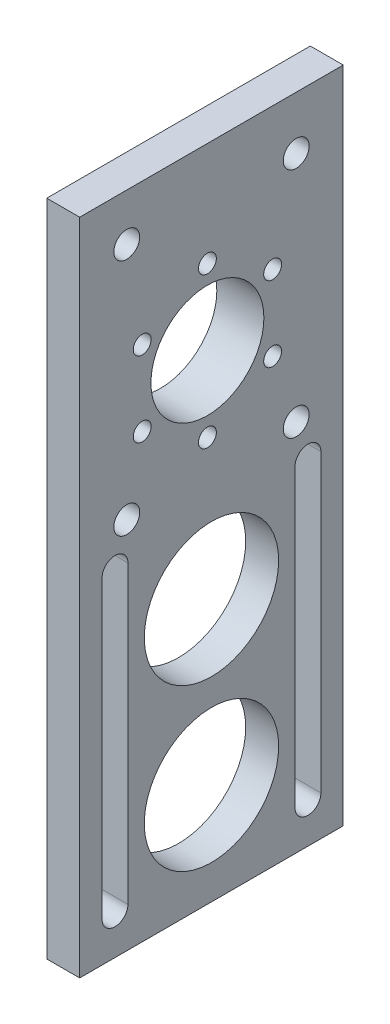
ISO-10303-21;
HEADER;
FILE_DESCRIPTION(('STEP AP214'),'2;1');
FILE_NAME('part.step','',(''),(''),'','','');
FILE_SCHEMA(('AUTOMOTIVE_DESIGN { 1 0 10303 214 1 1 1 1 }'));
ENDSEC;
DATA;
#1=APPLICATION_CONTEXT('core data for automotive mechanical design processes');
#2=APPLICATION_PROTOCOL_DEFINITION('international standard','automotive_design',2000,#1);
#3=PRODUCT_CONTEXT('',#1,'mechanical');
#4=PRODUCT('Part','Part','',(#3));
#5=PRODUCT_RELATED_PRODUCT_CATEGORY('part','',(#4));
#6=PRODUCT_DEFINITION_FORMATION('','',#4);
#7=PRODUCT_DEFINITION_CONTEXT('part definition',#1,'design');
#8=PRODUCT_DEFINITION('design','',#6,#7);
#9=PRODUCT_DEFINITION_SHAPE('','',#8);
#10=(LENGTH_UNIT() NAMED_UNIT(*) SI_UNIT(.MILLI.,.METRE.));
#11=(NAMED_UNIT(*) PLANE_ANGLE_UNIT() SI_UNIT($,.RADIAN.));
#12=(NAMED_UNIT(*) SI_UNIT($,.STERADIAN.) SOLID_ANGLE_UNIT());
#13=UNCERTAINTY_MEASURE_WITH_UNIT(LENGTH_MEASURE(1.E-05),#10,'distance_accuracy_value','');
#14=(GEOMETRIC_REPRESENTATION_CONTEXT(3) GLOBAL_UNCERTAINTY_ASSIGNED_CONTEXT((#13)) GLOBAL_UNIT_ASSIGNED_CONTEXT((#10,
#11,#12)) REPRESENTATION_CONTEXT('',''));
#15=CARTESIAN_POINT('',(0.,0.,0.));
#16=DIRECTION('',(0.,0.,1.));
#17=DIRECTION('',(1.,0.,0.));
#18=AXIS2_PLACEMENT_3D('',#15,#16,#17);
#19=CARTESIAN_POINT('',(7.,0.,0.));
#20=DIRECTION('',(0.,0.,-1.));
#21=DIRECTION('',(-1.,0.,0.));
#22=AXIS2_PLACEMENT_3D('',#19,#20,#21);
#23=PLANE('',#22);
#24=DIRECTION('',(0.,-1.,0.));
#25=VECTOR('',#24,1.);
#26=CARTESIAN_POINT('',(0.,0.,0.));
#27=LINE('',#26,#25);
#28=CARTESIAN_POINT('',(0.,140.,0.));
#29=VERTEX_POINT('',#28);
#30=CARTESIAN_POINT('',(0.,0.,0.));
#31=VERTEX_POINT('',#30);
#32=EDGE_CURVE('E277',#29,#31,#27,.T.);
#33=ORIENTED_EDGE('',*,*,#32,.T.);
#34=DIRECTION('',(-1.,0.,0.));
#35=VECTOR('',#34,1.);
#36=CARTESIAN_POINT('',(7.,0.,0.));
#37=LINE('',#36,#35);
#38=CARTESIAN_POINT('',(7.,0.,0.));
#39=VERTEX_POINT('',#38);
#40=EDGE_CURVE('E11',#39,#31,#37,.T.);
#41=ORIENTED_EDGE('',*,*,#40,.F.);
#42=DIRECTION('',(0.,-1.,0.));
#43=VECTOR('',#42,1.);
#44=CARTESIAN_POINT('',(7.,0.,0.));
#45=LINE('',#44,#43);
#46=CARTESIAN_POINT('',(7.,140.,0.));
#47=VERTEX_POINT('',#46);
#48=EDGE_CURVE('E309',#47,#39,#45,.T.);
#49=ORIENTED_EDGE('',*,*,#48,.F.);
#50=DIRECTION('',(-1.,0.,0.));
#51=VECTOR('',#50,1.);
#52=CARTESIAN_POINT('',(7.,140.,0.));
#53=LINE('',#52,#51);
#54=EDGE_CURVE('E318',#47,#29,#53,.T.);
#55=ORIENTED_EDGE('',*,*,#54,.T.);
#56=EDGE_LOOP('',(#33,#41,#49,#55));
#57=FACE_BOUND('',#56,.T.);
#58=ADVANCED_FACE('F39',(#57),#23,.F.);
#59=CARTESIAN_POINT('',(7.,0.,0.));
#60=DIRECTION('',(0.,1.,0.));
#61=DIRECTION('',(0.,0.,1.));
#62=AXIS2_PLACEMENT_3D('',#59,#60,#61);
#63=PLANE('',#62);
#64=DIRECTION('',(0.,0.,-1.));
#65=VECTOR('',#64,1.);
#66=CARTESIAN_POINT('',(0.,0.,0.));
#67=LINE('',#66,#65);
#68=CARTESIAN_POINT('',(0.,0.,-56.));
#69=VERTEX_POINT('',#68);
#70=EDGE_CURVE('E325',#31,#69,#67,.T.);
#71=ORIENTED_EDGE('',*,*,#70,.T.);
#72=DIRECTION('',(-1.,0.,0.));
#73=VECTOR('',#72,1.);
#74=CARTESIAN_POINT('',(7.,0.,-56.));
#75=LINE('',#74,#73);
#76=CARTESIAN_POINT('',(7.,0.,-56.));
#77=VERTEX_POINT('',#76);
#78=EDGE_CURVE('E46',#77,#69,#75,.T.);
#79=ORIENTED_EDGE('',*,*,#78,.F.);
#80=DIRECTION('',(0.,0.,-1.));
#81=VECTOR('',#80,1.);
#82=CARTESIAN_POINT('',(7.,0.,0.));
#83=LINE('',#82,#81);
#84=EDGE_CURVE('E312',#39,#77,#83,.T.);
#85=ORIENTED_EDGE('',*,*,#84,.F.);
#86=ORIENTED_EDGE('',*,*,#40,.T.);
#87=EDGE_LOOP('',(#71,#79,#85,#86));
#88=FACE_BOUND('',#87,.T.);
#89=ADVANCED_FACE('F352',(#88),#63,.F.);
#90=CARTESIAN_POINT('',(7.,0.,-56.));
#91=DIRECTION('',(0.,0.,1.));
#92=DIRECTION('',(1.,0.,0.));
#93=AXIS2_PLACEMENT_3D('',#90,#91,#92);
#94=PLANE('',#93);
#95=DIRECTION('',(0.,1.,0.));
#96=VECTOR('',#95,1.);
#97=CARTESIAN_POINT('',(0.,0.,-56.));
#98=LINE('',#97,#96);
#99=CARTESIAN_POINT('',(0.,140.,-56.));
#100=VERTEX_POINT('',#99);
#101=EDGE_CURVE('E322',#69,#100,#98,.T.);
#102=ORIENTED_EDGE('',*,*,#101,.T.);
#103=DIRECTION('',(-1.,0.,0.));
#104=VECTOR('',#103,1.);
#105=CARTESIAN_POINT('',(7.,140.,-56.));
#106=LINE('',#105,#104);
#107=CARTESIAN_POINT('',(7.,140.,-56.));
#108=VERTEX_POINT('',#107);
#109=EDGE_CURVE('E329',#108,#100,#106,.T.);
#110=ORIENTED_EDGE('',*,*,#109,.F.);
#111=DIRECTION('',(0.,1.,0.));
#112=VECTOR('',#111,1.);
#113=CARTESIAN_POINT('',(7.,0.,-56.));
#114=LINE('',#113,#112);
#115=EDGE_CURVE('E317',#77,#108,#114,.T.);
#116=ORIENTED_EDGE('',*,*,#115,.F.);
#117=ORIENTED_EDGE('',*,*,#78,.T.);
#118=EDGE_LOOP('',(#102,#110,#116,#117));
#119=FACE_BOUND('',#118,.T.);
#120=ADVANCED_FACE('F340',(#119),#94,.F.);
#121=CARTESIAN_POINT('',(7.,140.,0.));
#122=DIRECTION('',(0.,-1.,0.));
#123=DIRECTION('',(0.,0.,-1.));
#124=AXIS2_PLACEMENT_3D('',#121,#122,#123);
#125=PLANE('',#124);
#126=DIRECTION('',(0.,0.,1.));
#127=VECTOR('',#126,1.);
#128=CARTESIAN_POINT('',(0.,140.,0.));
#129=LINE('',#128,#127);
#130=EDGE_CURVE('E313',#100,#29,#129,.T.);
#131=ORIENTED_EDGE('',*,*,#130,.T.);
#132=ORIENTED_EDGE('',*,*,#54,.F.);
#133=DIRECTION('',(0.,0.,1.));
#134=VECTOR('',#133,1.);
#135=CARTESIAN_POINT('',(7.,140.,0.));
#136=LINE('',#135,#134);
#137=EDGE_CURVE('E319',#108,#47,#136,.T.);
#138=ORIENTED_EDGE('',*,*,#137,.F.);
#139=ORIENTED_EDGE('',*,*,#109,.T.);
#140=EDGE_LOOP('',(#131,#132,#138,#139));
#141=FACE_BOUND('',#140,.T.);
#142=ADVANCED_FACE('F346',(#141),#125,.F.);
#143=CARTESIAN_POINT('',(7.,0.,0.));
#144=DIRECTION('',(-1.,0.,0.));
#145=DIRECTION('',(0.,0.,1.));
#146=AXIS2_PLACEMENT_3D('',#143,#144,#145);
#147=PLANE('',#146);
#148=CARTESIAN_POINT('',(7.,79.3508193965806,-10.));
#149=DIRECTION('',(1.,0.,0.));
#150=DIRECTION('',(0.,0.,-1.));
#151=AXIS2_PLACEMENT_3D('',#148,#149,#150);
#152=CIRCLE('',#151,2.75);
#153=CARTESIAN_POINT('',(7.,79.3508193965806,-12.75));
#154=VERTEX_POINT('',#153);
#155=EDGE_CURVE('E187',#154,#154,#152,.T.);
#156=ORIENTED_EDGE('',*,*,#155,.F.);
#157=EDGE_LOOP('',(#156));
#158=FACE_BOUND('',#157,.T.);
#159=CARTESIAN_POINT('',(7.,79.3508193965806,-46.));
#160=DIRECTION('',(1.,0.,0.));
#161=DIRECTION('',(0.,0.,-1.));
#162=AXIS2_PLACEMENT_3D('',#159,#160,#161);
#163=CIRCLE('',#162,2.75);
#164=CARTESIAN_POINT('',(7.,79.3508193965806,-48.75));
#165=VERTEX_POINT('',#164);
#166=EDGE_CURVE('E197',#165,#165,#163,.T.);
#167=ORIENTED_EDGE('',*,*,#166,.F.);
#168=EDGE_LOOP('',(#167));
#169=FACE_BOUND('',#168,.T.);
#170=CARTESIAN_POINT('',(7.,128.741828228234,-46.));
#171=DIRECTION('',(1.,0.,0.));
#172=DIRECTION('',(0.,0.,-1.));
#173=AXIS2_PLACEMENT_3D('',#170,#171,#172);
#174=CIRCLE('',#173,2.75);
#175=CARTESIAN_POINT('',(7.,128.741828228234,-48.75));
#176=VERTEX_POINT('',#175);
#177=EDGE_CURVE('E191',#176,#176,#174,.T.);
#178=ORIENTED_EDGE('',*,*,#177,.F.);
#179=EDGE_LOOP('',(#178));
#180=FACE_BOUND('',#179,.T.);
#181=CARTESIAN_POINT('',(7.,130.,-10.));
#182=DIRECTION('',(1.,0.,0.));
#183=DIRECTION('',(0.,0.,-1.));
#184=AXIS2_PLACEMENT_3D('',#181,#182,#183);
#185=CIRCLE('',#184,2.75);
#186=CARTESIAN_POINT('',(7.,130.,-12.75));
#187=VERTEX_POINT('',#186);
#188=EDGE_CURVE('E192',#187,#187,#185,.T.);
#189=ORIENTED_EDGE('',*,*,#188,.F.);
#190=EDGE_LOOP('',(#189));
#191=FACE_BOUND('',#190,.T.);
#192=DIRECTION('',(0.,-1.,0.));
#193=VECTOR('',#192,1.);
#194=CARTESIAN_POINT('',(7.,71.2448174184033,-4.75));
#195=LINE('',#194,#193);
#196=CARTESIAN_POINT('',(7.,71.2448174184033,-4.75));
#197=VERTEX_POINT('',#196);
#198=CARTESIAN_POINT('',(7.,8.43498525922826,-4.75000000000001));
#199=VERTEX_POINT('',#198);
#200=EDGE_CURVE('E230',#197,#199,#195,.T.);
#201=ORIENTED_EDGE('',*,*,#200,.F.);
#202=CARTESIAN_POINT('',(7.,71.2448174184033,-7.5));
#203=DIRECTION('',(1.,0.,0.));
#204=DIRECTION('',(0.,0.,-1.));
#205=AXIS2_PLACEMENT_3D('',#202,#203,#204);
#206=CIRCLE('',#205,2.75);
#207=CARTESIAN_POINT('',(7.,71.2448174184033,-10.25));
#208=VERTEX_POINT('',#207);
#209=EDGE_CURVE('E227',#208,#197,#206,.T.);
#210=ORIENTED_EDGE('',*,*,#209,.F.);
#211=DIRECTION('',(0.,1.,0.));
#212=VECTOR('',#211,1.);
#213=CARTESIAN_POINT('',(7.,71.2448174184033,-10.25));
#214=LINE('',#213,#212);
#215=CARTESIAN_POINT('',(7.,8.43498525922826,-10.25));
#216=VERTEX_POINT('',#215);
#217=EDGE_CURVE('E220',#216,#208,#214,.T.);
#218=ORIENTED_EDGE('',*,*,#217,.F.);
#219=CARTESIAN_POINT('',(7.,8.43498525922826,-7.50000000000001));
#220=DIRECTION('',(1.,0.,0.));
#221=DIRECTION('',(0.,0.,-1.));
#222=AXIS2_PLACEMENT_3D('',#219,#220,#221);
#223=CIRCLE('',#222,2.75);
#224=EDGE_CURVE('E231',#199,#216,#223,.T.);
#225=ORIENTED_EDGE('',*,*,#224,.F.);
#226=EDGE_LOOP('',(#201,#210,#218,#225));
#227=FACE_BOUND('',#226,.T.);
#228=DIRECTION('',(0.,1.,0.));
#229=VECTOR('',#228,1.);
#230=CARTESIAN_POINT('',(7.,8.43498525922826,-51.25));
#231=LINE('',#230,#229);
#232=CARTESIAN_POINT('',(7.,8.43498525922826,-51.25));
#233=VERTEX_POINT('',#232);
#234=CARTESIAN_POINT('',(7.,71.2448174184033,-51.25));
#235=VERTEX_POINT('',#234);
#236=EDGE_CURVE('E263',#233,#235,#231,.T.);
#237=ORIENTED_EDGE('',*,*,#236,.F.);
#238=CARTESIAN_POINT('',(7.,8.43498525922826,-48.5));
#239=DIRECTION('',(1.,0.,0.));
#240=DIRECTION('',(0.,0.,-1.));
#241=AXIS2_PLACEMENT_3D('',#238,#239,#240);
#242=CIRCLE('',#241,2.75);
#243=CARTESIAN_POINT('',(7.,8.43498525922826,-45.75));
#244=VERTEX_POINT('',#243);
#245=EDGE_CURVE('E229',#244,#233,#242,.T.);
#246=ORIENTED_EDGE('',*,*,#245,.F.);
#247=DIRECTION('',(0.,-1.,0.));
#248=VECTOR('',#247,1.);
#249=CARTESIAN_POINT('',(7.,8.43498525922826,-45.75));
#250=LINE('',#249,#248);
#251=CARTESIAN_POINT('',(7.,71.2448174184033,-45.75));
#252=VERTEX_POINT('',#251);
#253=EDGE_CURVE('E259',#252,#244,#250,.T.);
#254=ORIENTED_EDGE('',*,*,#253,.F.);
#255=CARTESIAN_POINT('',(7.,71.2448174184033,-48.5));
#256=DIRECTION('',(1.,0.,0.));
#257=DIRECTION('',(0.,0.,-1.));
#258=AXIS2_PLACEMENT_3D('',#255,#256,#257);
#259=CIRCLE('',#258,2.75);
#260=EDGE_CURVE('E258',#235,#252,#259,.T.);
#261=ORIENTED_EDGE('',*,*,#260,.F.);
#262=EDGE_LOOP('',(#237,#246,#254,#261));
#263=FACE_BOUND('',#262,.T.);
#264=CARTESIAN_POINT('',(7.,21.5162892782246,-28.));
#265=DIRECTION('',(1.,0.,0.));
#266=DIRECTION('',(0.,0.,-1.));
#267=AXIS2_PLACEMENT_3D('',#264,#265,#266);
#268=CIRCLE('',#267,14.275);
#269=CARTESIAN_POINT('',(7.,21.5162892782246,-42.275));
#270=VERTEX_POINT('',#269);
#271=EDGE_CURVE('E281',#270,#270,#268,.T.);
#272=ORIENTED_EDGE('',*,*,#271,.F.);
#273=EDGE_LOOP('',(#272));
#274=FACE_BOUND('',#273,.T.);
#275=CARTESIAN_POINT('',(7.,109.914121240524,-13.2812153855492));
#276=DIRECTION('',(1.,0.,0.));
#277=DIRECTION('',(0.,0.,-1.));
#278=AXIS2_PLACEMENT_3D('',#275,#276,#277);
#279=CIRCLE('',#278,1.9);
#280=CARTESIAN_POINT('',(7.,109.914121240524,-15.1812153855492));
#281=VERTEX_POINT('',#280);
#282=EDGE_CURVE('E293',#281,#281,#279,.T.);
#283=ORIENTED_EDGE('',*,*,#282,.F.);
#284=EDGE_LOOP('',(#283));
#285=FACE_BOUND('',#284,.T.);
#286=CARTESIAN_POINT('',(7.,93.9141212405243,-40.9940283066512));
#287=DIRECTION('',(1.,0.,0.));
#288=DIRECTION('',(0.,0.,-1.));
#289=AXIS2_PLACEMENT_3D('',#286,#287,#288);
#290=CIRCLE('',#289,1.9);
#291=CARTESIAN_POINT('',(7.,93.9141212405243,-42.8940283066512));
#292=VERTEX_POINT('',#291);
#293=EDGE_CURVE('E287',#292,#292,#290,.T.);
#294=ORIENTED_EDGE('',*,*,#293,.F.);
#295=EDGE_LOOP('',(#294));
#296=FACE_BOUND('',#295,.T.);
#297=CARTESIAN_POINT('',(7.,85.9141212405242,-27.1376218461002));
#298=DIRECTION('',(1.,0.,0.));
#299=DIRECTION('',(0.,0.,-1.));
#300=AXIS2_PLACEMENT_3D('',#297,#298,#299);
#301=CIRCLE('',#300,1.9);
#302=CARTESIAN_POINT('',(7.,85.9141212405242,-29.0376218461002));
#303=VERTEX_POINT('',#302);
#304=EDGE_CURVE('E284',#303,#303,#301,.T.);
#305=ORIENTED_EDGE('',*,*,#304,.F.);
#306=EDGE_LOOP('',(#305));
#307=FACE_BOUND('',#306,.T.);
#308=CARTESIAN_POINT('',(7.,93.9141212405243,-13.2812153855491));
#309=DIRECTION('',(1.,0.,0.));
#310=DIRECTION('',(0.,0.,-1.));
#311=AXIS2_PLACEMENT_3D('',#308,#309,#310);
#312=CIRCLE('',#311,1.9);
#313=CARTESIAN_POINT('',(7.,93.9141212405243,-15.1812153855491));
#314=VERTEX_POINT('',#313);
#315=EDGE_CURVE('E239',#314,#314,#312,.T.);
#316=ORIENTED_EDGE('',*,*,#315,.F.);
#317=EDGE_LOOP('',(#316));
#318=FACE_BOUND('',#317,.T.);
#319=CARTESIAN_POINT('',(7.,55.7275984769063,-28.));
#320=DIRECTION('',(1.,0.,0.));
#321=DIRECTION('',(0.,0.,-1.));
#322=AXIS2_PLACEMENT_3D('',#319,#320,#321);
#323=CIRCLE('',#322,14.275);
#324=CARTESIAN_POINT('',(7.,55.7275984769063,-42.275));
#325=VERTEX_POINT('',#324);
#326=EDGE_CURVE('E282',#325,#325,#323,.T.);
#327=ORIENTED_EDGE('',*,*,#326,.F.);
#328=EDGE_LOOP('',(#327));
#329=FACE_BOUND('',#328,.T.);
#330=CARTESIAN_POINT('',(7.,101.914121240524,-27.1376218461001));
#331=DIRECTION('',(1.,0.,0.));
#332=DIRECTION('',(0.,0.,-1.));
#333=AXIS2_PLACEMENT_3D('',#330,#331,#332);
#334=CIRCLE('',#333,12.);
#335=CARTESIAN_POINT('',(7.,101.914121240524,-39.1376218461001));
#336=VERTEX_POINT('',#335);
#337=EDGE_CURVE('E297',#336,#336,#334,.T.);
#338=ORIENTED_EDGE('',*,*,#337,.F.);
#339=EDGE_LOOP('',(#338));
#340=FACE_BOUND('',#339,.T.);
#341=CARTESIAN_POINT('',(7.,109.914121240524,-40.9940283066512));
#342=DIRECTION('',(1.,0.,0.));
#343=DIRECTION('',(0.,0.,-1.));
#344=AXIS2_PLACEMENT_3D('',#341,#342,#343);
#345=CIRCLE('',#344,1.9);
#346=CARTESIAN_POINT('',(7.,109.914121240524,-42.8940283066512));
#347=VERTEX_POINT('',#346);
#348=EDGE_CURVE('E300',#347,#347,#345,.T.);
#349=ORIENTED_EDGE('',*,*,#348,.F.);
#350=EDGE_LOOP('',(#349));
#351=FACE_BOUND('',#350,.T.);
#352=CARTESIAN_POINT('',(7.,117.914121240524,-27.1376218461002));
#353=DIRECTION('',(1.,0.,0.));
#354=DIRECTION('',(0.,0.,-1.));
#355=AXIS2_PLACEMENT_3D('',#352,#353,#354);
#356=CIRCLE('',#355,1.9);
#357=CARTESIAN_POINT('',(7.,117.914121240524,-29.0376218461002));
#358=VERTEX_POINT('',#357);
#359=EDGE_CURVE('E295',#358,#358,#356,.T.);
#360=ORIENTED_EDGE('',*,*,#359,.F.);
#361=EDGE_LOOP('',(#360));
#362=FACE_BOUND('',#361,.T.);
#363=ORIENTED_EDGE('',*,*,#48,.T.);
#364=ORIENTED_EDGE('',*,*,#84,.T.);
#365=ORIENTED_EDGE('',*,*,#115,.T.);
#366=ORIENTED_EDGE('',*,*,#137,.T.);
#367=EDGE_LOOP('',(#363,#364,#365,#366));
#368=FACE_BOUND('',#367,.T.);
#369=ADVANCED_FACE('F354',(#158,#169,#180,#191,#227,#263,#274,#285,#296,#307,#318,#329,#340,
#351,#362,#368),#147,.F.);
#370=CARTESIAN_POINT('',(0.,0.,0.));
#371=DIRECTION('',(-1.,0.,0.));
#372=DIRECTION('',(0.,0.,1.));
#373=AXIS2_PLACEMENT_3D('',#370,#371,#372);
#374=PLANE('',#373);
#375=DIRECTION('',(0.,0.999916383960929,0.0129315539089404));
#376=VECTOR('',#375,1.);
#377=CARTESIAN_POINT('',(0.,92.25013910741,-10.8880838921783));
#378=LINE('',#377,#376);
#379=CARTESIAN_POINT('',(0.,92.25013910741,-10.8880838921783));
#380=VERTEX_POINT('',#379);
#381=CARTESIAN_POINT('',(0.,111.154642841823,-10.6435988401433));
#382=VERTEX_POINT('',#381);
#383=EDGE_CURVE('E52',#380,#382,#378,.T.);
#384=ORIENTED_EDGE('',*,*,#383,.F.);
#385=DIRECTION('',(0.,0.488759137784914,0.87241876712491));
#386=VECTOR('',#385,1.);
#387=CARTESIAN_POINT('',(0.,83.0096175061114,-27.3821068981352));
#388=LINE('',#387,#386);
#389=CARTESIAN_POINT('',(0.,83.0096175061114,-27.3821068981352));
#390=VERTEX_POINT('',#389);
#391=EDGE_CURVE('E60',#390,#380,#388,.T.);
#392=ORIENTED_EDGE('',*,*,#391,.F.);
#393=DIRECTION('',(0.,-0.511157246176016,0.859487213215969));
#394=VECTOR('',#393,1.);
#395=CARTESIAN_POINT('',(0.,92.6735996392257,-43.6316448520569));
#396=LINE('',#395,#394);
#397=CARTESIAN_POINT('',(0.,92.6735996392257,-43.6316448520569));
#398=VERTEX_POINT('',#397);
#399=EDGE_CURVE('E524',#398,#390,#396,.T.);
#400=ORIENTED_EDGE('',*,*,#399,.F.);
#401=DIRECTION('',(0.,-0.999916383960929,-0.0129315539089398));
#402=VECTOR('',#401,1.);
#403=CARTESIAN_POINT('',(0.,111.578103373639,-43.387159800022));
#404=LINE('',#403,#402);
#405=CARTESIAN_POINT('',(0.,111.578103373639,-43.387159800022));
#406=VERTEX_POINT('',#405);
#407=EDGE_CURVE('E525',#406,#398,#404,.T.);
#408=ORIENTED_EDGE('',*,*,#407,.F.);
#409=DIRECTION('',(0.,-0.488759137784914,-0.87241876712491));
#410=VECTOR('',#409,1.);
#411=CARTESIAN_POINT('',(0.,120.818624974937,-26.8931367940651));
#412=LINE('',#411,#410);
#413=CARTESIAN_POINT('',(0.,120.818624974937,-26.8931367940651));
#414=VERTEX_POINT('',#413);
#415=EDGE_CURVE('E518',#414,#406,#412,.T.);
#416=ORIENTED_EDGE('',*,*,#415,.F.);
#417=DIRECTION('',(0.,0.511157246176014,-0.859487213215969));
#418=VECTOR('',#417,1.);
#419=CARTESIAN_POINT('',(0.,111.154642841823,-10.6435988401433));
#420=LINE('',#419,#418);
#421=EDGE_CURVE('E504',#382,#414,#420,.T.);
#422=ORIENTED_EDGE('',*,*,#421,.F.);
#423=EDGE_LOOP('',(#384,#392,#400,#408,#416,#422));
#424=FACE_BOUND('',#423,.T.);
#425=CARTESIAN_POINT('',(0.,79.3508193965806,-10.));
#426=DIRECTION('',(1.,0.,0.));
#427=DIRECTION('',(0.,0.,-1.));
#428=AXIS2_PLACEMENT_3D('',#425,#426,#427);
#429=CIRCLE('',#428,2.75);
#430=CARTESIAN_POINT('',(0.,79.3508193965806,-12.75));
#431=VERTEX_POINT('',#430);
#432=EDGE_CURVE('E182',#431,#431,#429,.T.);
#433=ORIENTED_EDGE('',*,*,#432,.T.);
#434=EDGE_LOOP('',(#433));
#435=FACE_BOUND('',#434,.T.);
#436=CARTESIAN_POINT('',(0.,79.3508193965806,-46.));
#437=DIRECTION('',(1.,0.,0.));
#438=DIRECTION('',(0.,0.,-1.));
#439=AXIS2_PLACEMENT_3D('',#436,#437,#438);
#440=CIRCLE('',#439,2.75);
#441=CARTESIAN_POINT('',(0.,79.3508193965806,-48.75));
#442=VERTEX_POINT('',#441);
#443=EDGE_CURVE('E204',#442,#442,#440,.T.);
#444=ORIENTED_EDGE('',*,*,#443,.T.);
#445=EDGE_LOOP('',(#444));
#446=FACE_BOUND('',#445,.T.);
#447=CARTESIAN_POINT('',(0.,128.741828228234,-46.));
#448=DIRECTION('',(1.,0.,0.));
#449=DIRECTION('',(0.,0.,-1.));
#450=AXIS2_PLACEMENT_3D('',#447,#448,#449);
#451=CIRCLE('',#450,2.75);
#452=CARTESIAN_POINT('',(0.,128.741828228234,-48.75));
#453=VERTEX_POINT('',#452);
#454=EDGE_CURVE('E196',#453,#453,#451,.T.);
#455=ORIENTED_EDGE('',*,*,#454,.T.);
#456=EDGE_LOOP('',(#455));
#457=FACE_BOUND('',#456,.T.);
#458=CARTESIAN_POINT('',(0.,130.,-10.));
#459=DIRECTION('',(1.,0.,0.));
#460=DIRECTION('',(0.,0.,-1.));
#461=AXIS2_PLACEMENT_3D('',#458,#459,#460);
#462=CIRCLE('',#461,2.75);
#463=CARTESIAN_POINT('',(0.,130.,-12.75));
#464=VERTEX_POINT('',#463);
#465=EDGE_CURVE('E210',#464,#464,#462,.T.);
#466=ORIENTED_EDGE('',*,*,#465,.T.);
#467=EDGE_LOOP('',(#466));
#468=FACE_BOUND('',#467,.T.);
#469=CARTESIAN_POINT('',(0.,71.2448174184033,-7.5));
#470=DIRECTION('',(1.,0.,0.));
#471=DIRECTION('',(0.,0.,-1.));
#472=AXIS2_PLACEMENT_3D('',#469,#470,#471);
#473=CIRCLE('',#472,2.75);
#474=CARTESIAN_POINT('',(0.,71.2448174184033,-10.25));
#475=VERTEX_POINT('',#474);
#476=CARTESIAN_POINT('',(0.,71.2448174184033,-4.75));
#477=VERTEX_POINT('',#476);
#478=EDGE_CURVE('E215',#475,#477,#473,.T.);
#479=ORIENTED_EDGE('',*,*,#478,.T.);
#480=DIRECTION('',(0.,-1.,0.));
#481=VECTOR('',#480,1.);
#482=CARTESIAN_POINT('',(0.,71.2448174184033,-4.75));
#483=LINE('',#482,#481);
#484=CARTESIAN_POINT('',(0.,8.43498525922826,-4.75000000000001));
#485=VERTEX_POINT('',#484);
#486=EDGE_CURVE('E216',#477,#485,#483,.T.);
#487=ORIENTED_EDGE('',*,*,#486,.T.);
#488=CARTESIAN_POINT('',(0.,8.43498525922826,-7.50000000000001));
#489=DIRECTION('',(1.,0.,0.));
#490=DIRECTION('',(0.,0.,-1.));
#491=AXIS2_PLACEMENT_3D('',#488,#489,#490);
#492=CIRCLE('',#491,2.75);
#493=CARTESIAN_POINT('',(0.,8.43498525922826,-10.25));
#494=VERTEX_POINT('',#493);
#495=EDGE_CURVE('E219',#485,#494,#492,.T.);
#496=ORIENTED_EDGE('',*,*,#495,.T.);
#497=DIRECTION('',(0.,1.,0.));
#498=VECTOR('',#497,1.);
#499=CARTESIAN_POINT('',(0.,71.2448174184033,-10.25));
#500=LINE('',#499,#498);
#501=EDGE_CURVE('E222',#494,#475,#500,.T.);
#502=ORIENTED_EDGE('',*,*,#501,.T.);
#503=EDGE_LOOP('',(#479,#487,#496,#502));
#504=FACE_BOUND('',#503,.T.);
#505=CARTESIAN_POINT('',(0.,8.43498525922826,-48.5));
#506=DIRECTION('',(1.,0.,0.));
#507=DIRECTION('',(0.,0.,-1.));
#508=AXIS2_PLACEMENT_3D('',#505,#506,#507);
#509=CIRCLE('',#508,2.75);
#510=CARTESIAN_POINT('',(0.,8.43498525922826,-45.75));
#511=VERTEX_POINT('',#510);
#512=CARTESIAN_POINT('',(0.,8.43498525922826,-51.25));
#513=VERTEX_POINT('',#512);
#514=EDGE_CURVE('E257',#511,#513,#509,.T.);
#515=ORIENTED_EDGE('',*,*,#514,.T.);
#516=DIRECTION('',(0.,1.,0.));
#517=VECTOR('',#516,1.);
#518=CARTESIAN_POINT('',(0.,8.43498525922826,-51.25));
#519=LINE('',#518,#517);
#520=CARTESIAN_POINT('',(0.,71.2448174184033,-51.25));
#521=VERTEX_POINT('',#520);
#522=EDGE_CURVE('E275',#513,#521,#519,.T.);
#523=ORIENTED_EDGE('',*,*,#522,.T.);
#524=CARTESIAN_POINT('',(0.,71.2448174184033,-48.5));
#525=DIRECTION('',(1.,0.,0.));
#526=DIRECTION('',(0.,0.,-1.));
#527=AXIS2_PLACEMENT_3D('',#524,#525,#526);
#528=CIRCLE('',#527,2.75);
#529=CARTESIAN_POINT('',(0.,71.2448174184033,-45.75));
#530=VERTEX_POINT('',#529);
#531=EDGE_CURVE('E270',#521,#530,#528,.T.);
#532=ORIENTED_EDGE('',*,*,#531,.T.);
#533=DIRECTION('',(0.,-1.,0.));
#534=VECTOR('',#533,1.);
#535=CARTESIAN_POINT('',(0.,8.43498525922826,-45.75));
#536=LINE('',#535,#534);
#537=EDGE_CURVE('E249',#530,#511,#536,.T.);
#538=ORIENTED_EDGE('',*,*,#537,.T.);
#539=EDGE_LOOP('',(#515,#523,#532,#538));
#540=FACE_BOUND('',#539,.T.);
#541=CARTESIAN_POINT('',(0.,21.5162892782246,-28.));
#542=DIRECTION('',(1.,0.,0.));
#543=DIRECTION('',(0.,0.,-1.));
#544=AXIS2_PLACEMENT_3D('',#541,#542,#543);
#545=CIRCLE('',#544,14.275);
#546=CARTESIAN_POINT('',(0.,21.5162892782246,-42.275));
#547=VERTEX_POINT('',#546);
#548=EDGE_CURVE('E276',#547,#547,#545,.T.);
#549=ORIENTED_EDGE('',*,*,#548,.T.);
#550=EDGE_LOOP('',(#549));
#551=FACE_BOUND('',#550,.T.);
#552=CARTESIAN_POINT('',(0.,55.7275984769063,-28.));
#553=DIRECTION('',(1.,0.,0.));
#554=DIRECTION('',(0.,0.,-1.));
#555=AXIS2_PLACEMENT_3D('',#552,#553,#554);
#556=CIRCLE('',#555,14.275);
#557=CARTESIAN_POINT('',(0.,55.7275984769063,-42.275));
#558=VERTEX_POINT('',#557);
#559=EDGE_CURVE('E304',#558,#558,#556,.T.);
#560=ORIENTED_EDGE('',*,*,#559,.T.);
#561=EDGE_LOOP('',(#560));
#562=FACE_BOUND('',#561,.T.);
#563=ORIENTED_EDGE('',*,*,#32,.F.);
#564=ORIENTED_EDGE('',*,*,#130,.F.);
#565=ORIENTED_EDGE('',*,*,#101,.F.);
#566=ORIENTED_EDGE('',*,*,#70,.F.);
#567=EDGE_LOOP('',(#563,#564,#565,#566));
#568=FACE_BOUND('',#567,.T.);
#569=ADVANCED_FACE('F345',(#424,#435,#446,#457,#468,#504,#540,#551,#562,#568),#374,.T.);
#570=CARTESIAN_POINT('',(0.,117.914121240524,-27.1376218461002));
#571=DIRECTION('',(1.,0.,0.));
#572=DIRECTION('',(0.,0.,-1.));
#573=AXIS2_PLACEMENT_3D('',#570,#571,#572);
#574=CYLINDRICAL_SURFACE('',#573,1.9);
#575=ORIENTED_EDGE('',*,*,#359,.T.);
#576=EDGE_LOOP('',(#575));
#577=FACE_BOUND('',#576,.T.);
#578=CARTESIAN_POINT('',(-3.,117.914121240524,-27.1376218461002));
#579=DIRECTION('',(1.,0.,0.));
#580=DIRECTION('',(0.,0.,-1.));
#581=AXIS2_PLACEMENT_3D('',#578,#579,#580);
#582=CIRCLE('',#581,1.9);
#583=CARTESIAN_POINT('',(-3.,117.914121240524,-29.0376218461002));
#584=VERTEX_POINT('',#583);
#585=EDGE_CURVE('E492',#584,#584,#582,.T.);
#586=ORIENTED_EDGE('',*,*,#585,.F.);
#587=EDGE_LOOP('',(#586));
#588=FACE_BOUND('',#587,.T.);
#589=ADVANCED_FACE('F362',(#577,#588),#574,.F.);
#590=CARTESIAN_POINT('',(0.,109.914121240524,-40.9940283066512));
#591=DIRECTION('',(1.,0.,0.));
#592=DIRECTION('',(0.,0.,-1.));
#593=AXIS2_PLACEMENT_3D('',#590,#591,#592);
#594=CYLINDRICAL_SURFACE('',#593,1.9);
#595=ORIENTED_EDGE('',*,*,#348,.T.);
#596=EDGE_LOOP('',(#595));
#597=FACE_BOUND('',#596,.T.);
#598=CARTESIAN_POINT('',(-3.,109.914121240524,-40.9940283066512));
#599=DIRECTION('',(1.,0.,0.));
#600=DIRECTION('',(0.,0.,-1.));
#601=AXIS2_PLACEMENT_3D('',#598,#599,#600);
#602=CIRCLE('',#601,1.9);
#603=CARTESIAN_POINT('',(-3.,109.914121240524,-42.8940283066512));
#604=VERTEX_POINT('',#603);
#605=EDGE_CURVE('E493',#604,#604,#602,.T.);
#606=ORIENTED_EDGE('',*,*,#605,.F.);
#607=EDGE_LOOP('',(#606));
#608=FACE_BOUND('',#607,.T.);
#609=ADVANCED_FACE('F373',(#597,#608),#594,.F.);
#610=CARTESIAN_POINT('',(0.,101.914121240524,-27.1376218461001));
#611=DIRECTION('',(1.,0.,0.));
#612=DIRECTION('',(0.,0.,-1.));
#613=AXIS2_PLACEMENT_3D('',#610,#611,#612);
#614=CYLINDRICAL_SURFACE('',#613,12.);
#615=ORIENTED_EDGE('',*,*,#337,.T.);
#616=EDGE_LOOP('',(#615));
#617=FACE_BOUND('',#616,.T.);
#618=CARTESIAN_POINT('',(-3.,101.914121240524,-27.1376218461001));
#619=DIRECTION('',(1.,0.,0.));
#620=DIRECTION('',(0.,0.,-1.));
#621=AXIS2_PLACEMENT_3D('',#618,#619,#620);
#622=CIRCLE('',#621,12.);
#623=CARTESIAN_POINT('',(-3.,101.914121240524,-39.1376218461001));
#624=VERTEX_POINT('',#623);
#625=EDGE_CURVE('E497',#624,#624,#622,.T.);
#626=ORIENTED_EDGE('',*,*,#625,.F.);
#627=EDGE_LOOP('',(#626));
#628=FACE_BOUND('',#627,.T.);
#629=ADVANCED_FACE('F367',(#617,#628),#614,.F.);
#630=CARTESIAN_POINT('',(0.,55.7275984769063,-28.));
#631=DIRECTION('',(1.,0.,0.));
#632=DIRECTION('',(0.,0.,-1.));
#633=AXIS2_PLACEMENT_3D('',#630,#631,#632);
#634=CYLINDRICAL_SURFACE('',#633,14.275);
#635=ORIENTED_EDGE('',*,*,#559,.F.);
#636=EDGE_LOOP('',(#635));
#637=FACE_BOUND('',#636,.T.);
#638=ORIENTED_EDGE('',*,*,#326,.T.);
#639=EDGE_LOOP('',(#638));
#640=FACE_BOUND('',#639,.T.);
#641=ADVANCED_FACE('F375',(#637,#640),#634,.F.);
#642=CARTESIAN_POINT('',(0.,93.9141212405243,-13.2812153855491));
#643=DIRECTION('',(1.,0.,0.));
#644=DIRECTION('',(0.,0.,-1.));
#645=AXIS2_PLACEMENT_3D('',#642,#643,#644);
#646=CYLINDRICAL_SURFACE('',#645,1.9);
#647=ORIENTED_EDGE('',*,*,#315,.T.);
#648=EDGE_LOOP('',(#647));
#649=FACE_BOUND('',#648,.T.);
#650=CARTESIAN_POINT('',(-3.,93.9141212405243,-13.2812153855491));
#651=DIRECTION('',(1.,0.,0.));
#652=DIRECTION('',(0.,0.,-1.));
#653=AXIS2_PLACEMENT_3D('',#650,#651,#652);
#654=CIRCLE('',#653,1.9);
#655=CARTESIAN_POINT('',(-3.,93.9141212405243,-15.1812153855491));
#656=VERTEX_POINT('',#655);
#657=EDGE_CURVE('E477',#656,#656,#654,.T.);
#658=ORIENTED_EDGE('',*,*,#657,.F.);
#659=EDGE_LOOP('',(#658));
#660=FACE_BOUND('',#659,.T.);
#661=ADVANCED_FACE('F380',(#649,#660),#646,.F.);
#662=CARTESIAN_POINT('',(0.,85.9141212405242,-27.1376218461002));
#663=DIRECTION('',(1.,0.,0.));
#664=DIRECTION('',(0.,0.,-1.));
#665=AXIS2_PLACEMENT_3D('',#662,#663,#664);
#666=CYLINDRICAL_SURFACE('',#665,1.9);
#667=ORIENTED_EDGE('',*,*,#304,.T.);
#668=EDGE_LOOP('',(#667));
#669=FACE_BOUND('',#668,.T.);
#670=CARTESIAN_POINT('',(-3.,85.9141212405242,-27.1376218461002));
#671=DIRECTION('',(1.,0.,0.));
#672=DIRECTION('',(0.,0.,-1.));
#673=AXIS2_PLACEMENT_3D('',#670,#671,#672);
#674=CIRCLE('',#673,1.9);
#675=CARTESIAN_POINT('',(-3.,85.9141212405242,-29.0376218461002));
#676=VERTEX_POINT('',#675);
#677=EDGE_CURVE('E482',#676,#676,#674,.T.);
#678=ORIENTED_EDGE('',*,*,#677,.F.);
#679=EDGE_LOOP('',(#678));
#680=FACE_BOUND('',#679,.T.);
#681=ADVANCED_FACE('F388',(#669,#680),#666,.F.);
#682=CARTESIAN_POINT('',(0.,93.9141212405243,-40.9940283066512));
#683=DIRECTION('',(1.,0.,0.));
#684=DIRECTION('',(0.,0.,-1.));
#685=AXIS2_PLACEMENT_3D('',#682,#683,#684);
#686=CYLINDRICAL_SURFACE('',#685,1.9);
#687=ORIENTED_EDGE('',*,*,#293,.T.);
#688=EDGE_LOOP('',(#687));
#689=FACE_BOUND('',#688,.T.);
#690=CARTESIAN_POINT('',(-3.,93.9141212405243,-40.9940283066512));
#691=DIRECTION('',(1.,0.,0.));
#692=DIRECTION('',(0.,0.,-1.));
#693=AXIS2_PLACEMENT_3D('',#690,#691,#692);
#694=CIRCLE('',#693,1.9);
#695=CARTESIAN_POINT('',(-3.,93.9141212405243,-42.8940283066512));
#696=VERTEX_POINT('',#695);
#697=EDGE_CURVE('E487',#696,#696,#694,.T.);
#698=ORIENTED_EDGE('',*,*,#697,.F.);
#699=EDGE_LOOP('',(#698));
#700=FACE_BOUND('',#699,.T.);
#701=ADVANCED_FACE('F383',(#689,#700),#686,.F.);
#702=CARTESIAN_POINT('',(0.,109.914121240524,-13.2812153855492));
#703=DIRECTION('',(1.,0.,0.));
#704=DIRECTION('',(0.,0.,-1.));
#705=AXIS2_PLACEMENT_3D('',#702,#703,#704);
#706=CYLINDRICAL_SURFACE('',#705,1.9);
#707=ORIENTED_EDGE('',*,*,#282,.T.);
#708=EDGE_LOOP('',(#707));
#709=FACE_BOUND('',#708,.T.);
#710=CARTESIAN_POINT('',(-3.,109.914121240524,-13.2812153855492));
#711=DIRECTION('',(1.,0.,0.));
#712=DIRECTION('',(0.,0.,-1.));
#713=AXIS2_PLACEMENT_3D('',#710,#711,#712);
#714=CIRCLE('',#713,1.9);
#715=CARTESIAN_POINT('',(-3.,109.914121240524,-15.1812153855492));
#716=VERTEX_POINT('',#715);
#717=EDGE_CURVE('E505',#716,#716,#714,.T.);
#718=ORIENTED_EDGE('',*,*,#717,.F.);
#719=EDGE_LOOP('',(#718));
#720=FACE_BOUND('',#719,.T.);
#721=ADVANCED_FACE('F390',(#709,#720),#706,.F.);
#722=CARTESIAN_POINT('',(0.,21.5162892782246,-28.));
#723=DIRECTION('',(1.,0.,0.));
#724=DIRECTION('',(0.,0.,-1.));
#725=AXIS2_PLACEMENT_3D('',#722,#723,#724);
#726=CYLINDRICAL_SURFACE('',#725,14.275);
#727=ORIENTED_EDGE('',*,*,#548,.F.);
#728=EDGE_LOOP('',(#727));
#729=FACE_BOUND('',#728,.T.);
#730=ORIENTED_EDGE('',*,*,#271,.T.);
#731=EDGE_LOOP('',(#730));
#732=FACE_BOUND('',#731,.T.);
#733=ADVANCED_FACE('F393',(#729,#732),#726,.F.);
#734=CARTESIAN_POINT('',(0.,8.43498525922826,-48.5));
#735=DIRECTION('',(1.,0.,0.));
#736=DIRECTION('',(0.,0.,-1.));
#737=AXIS2_PLACEMENT_3D('',#734,#735,#736);
#738=CYLINDRICAL_SURFACE('',#737,2.75);
#739=ORIENTED_EDGE('',*,*,#245,.T.);
#740=DIRECTION('',(1.,0.,0.));
#741=VECTOR('',#740,1.);
#742=CARTESIAN_POINT('',(0.,8.43498525922826,-51.25));
#743=LINE('',#742,#741);
#744=EDGE_CURVE('E250',#513,#233,#743,.T.);
#745=ORIENTED_EDGE('',*,*,#744,.F.);
#746=ORIENTED_EDGE('',*,*,#514,.F.);
#747=DIRECTION('',(1.,0.,0.));
#748=VECTOR('',#747,1.);
#749=CARTESIAN_POINT('',(0.,8.43498525922826,-45.75));
#750=LINE('',#749,#748);
#751=EDGE_CURVE('E208',#511,#244,#750,.T.);
#752=ORIENTED_EDGE('',*,*,#751,.T.);
#753=EDGE_LOOP('',(#739,#745,#746,#752));
#754=FACE_BOUND('',#753,.T.);
#755=ADVANCED_FACE('F401',(#754),#738,.F.);
#756=CARTESIAN_POINT('',(0.,8.43498525922826,-45.75));
#757=DIRECTION('',(0.,0.,1.));
#758=DIRECTION('',(1.,0.,0.));
#759=AXIS2_PLACEMENT_3D('',#756,#757,#758);
#760=PLANE('',#759);
#761=ORIENTED_EDGE('',*,*,#253,.T.);
#762=ORIENTED_EDGE('',*,*,#751,.F.);
#763=ORIENTED_EDGE('',*,*,#537,.F.);
#764=DIRECTION('',(1.,0.,0.));
#765=VECTOR('',#764,1.);
#766=CARTESIAN_POINT('',(0.,71.2448174184033,-45.75));
#767=LINE('',#766,#765);
#768=EDGE_CURVE('E254',#530,#252,#767,.T.);
#769=ORIENTED_EDGE('',*,*,#768,.T.);
#770=EDGE_LOOP('',(#761,#762,#763,#769));
#771=FACE_BOUND('',#770,.T.);
#772=ADVANCED_FACE('F403',(#771),#760,.F.);
#773=CARTESIAN_POINT('',(0.,71.2448174184033,-48.5));
#774=DIRECTION('',(1.,0.,0.));
#775=DIRECTION('',(0.,0.,-1.));
#776=AXIS2_PLACEMENT_3D('',#773,#774,#775);
#777=CYLINDRICAL_SURFACE('',#776,2.75);
#778=ORIENTED_EDGE('',*,*,#260,.T.);
#779=ORIENTED_EDGE('',*,*,#768,.F.);
#780=ORIENTED_EDGE('',*,*,#531,.F.);
#781=DIRECTION('',(1.,0.,0.));
#782=VECTOR('',#781,1.);
#783=CARTESIAN_POINT('',(0.,71.2448174184033,-51.25));
#784=LINE('',#783,#782);
#785=EDGE_CURVE('E252',#521,#235,#784,.T.);
#786=ORIENTED_EDGE('',*,*,#785,.T.);
#787=EDGE_LOOP('',(#778,#779,#780,#786));
#788=FACE_BOUND('',#787,.T.);
#789=ADVANCED_FACE('F410',(#788),#777,.F.);
#790=CARTESIAN_POINT('',(0.,8.43498525922826,-51.25));
#791=DIRECTION('',(0.,0.,-1.));
#792=DIRECTION('',(-1.,0.,0.));
#793=AXIS2_PLACEMENT_3D('',#790,#791,#792);
#794=PLANE('',#793);
#795=ORIENTED_EDGE('',*,*,#236,.T.);
#796=ORIENTED_EDGE('',*,*,#785,.F.);
#797=ORIENTED_EDGE('',*,*,#522,.F.);
#798=ORIENTED_EDGE('',*,*,#744,.T.);
#799=EDGE_LOOP('',(#795,#796,#797,#798));
#800=FACE_BOUND('',#799,.T.);
#801=ADVANCED_FACE('F415',(#800),#794,.F.);
#802=CARTESIAN_POINT('',(0.,71.2448174184033,-7.5));
#803=DIRECTION('',(1.,0.,0.));
#804=DIRECTION('',(0.,0.,-1.));
#805=AXIS2_PLACEMENT_3D('',#802,#803,#804);
#806=CYLINDRICAL_SURFACE('',#805,2.75);
#807=ORIENTED_EDGE('',*,*,#209,.T.);
#808=DIRECTION('',(1.,0.,0.));
#809=VECTOR('',#808,1.);
#810=CARTESIAN_POINT('',(0.,71.2448174184033,-4.75));
#811=LINE('',#810,#809);
#812=EDGE_CURVE('E228',#477,#197,#811,.T.);
#813=ORIENTED_EDGE('',*,*,#812,.F.);
#814=ORIENTED_EDGE('',*,*,#478,.F.);
#815=DIRECTION('',(1.,0.,0.));
#816=VECTOR('',#815,1.);
#817=CARTESIAN_POINT('',(0.,71.2448174184033,-10.25));
#818=LINE('',#817,#816);
#819=EDGE_CURVE('E238',#475,#208,#818,.T.);
#820=ORIENTED_EDGE('',*,*,#819,.T.);
#821=EDGE_LOOP('',(#807,#813,#814,#820));
#822=FACE_BOUND('',#821,.T.);
#823=ADVANCED_FACE('F418',(#822),#806,.F.);
#824=CARTESIAN_POINT('',(0.,71.2448174184033,-10.25));
#825=DIRECTION('',(0.,0.,-1.));
#826=DIRECTION('',(0.,1.,0.));
#827=AXIS2_PLACEMENT_3D('',#824,#825,#826);
#828=PLANE('',#827);
#829=ORIENTED_EDGE('',*,*,#217,.T.);
#830=ORIENTED_EDGE('',*,*,#819,.F.);
#831=ORIENTED_EDGE('',*,*,#501,.F.);
#832=DIRECTION('',(1.,0.,0.));
#833=VECTOR('',#832,1.);
#834=CARTESIAN_POINT('',(0.,8.43498525922826,-10.25));
#835=LINE('',#834,#833);
#836=EDGE_CURVE('E241',#494,#216,#835,.T.);
#837=ORIENTED_EDGE('',*,*,#836,.T.);
#838=EDGE_LOOP('',(#829,#830,#831,#837));
#839=FACE_BOUND('',#838,.T.);
#840=ADVANCED_FACE('F421',(#839),#828,.F.);
#841=CARTESIAN_POINT('',(0.,8.43498525922826,-7.50000000000001));
#842=DIRECTION('',(1.,0.,0.));
#843=DIRECTION('',(0.,0.,-1.));
#844=AXIS2_PLACEMENT_3D('',#841,#842,#843);
#845=CYLINDRICAL_SURFACE('',#844,2.75);
#846=ORIENTED_EDGE('',*,*,#224,.T.);
#847=ORIENTED_EDGE('',*,*,#836,.F.);
#848=ORIENTED_EDGE('',*,*,#495,.F.);
#849=DIRECTION('',(1.,0.,0.));
#850=VECTOR('',#849,1.);
#851=CARTESIAN_POINT('',(0.,8.43498525922826,-4.75000000000001));
#852=LINE('',#851,#850);
#853=EDGE_CURVE('E243',#485,#199,#852,.T.);
#854=ORIENTED_EDGE('',*,*,#853,.T.);
#855=EDGE_LOOP('',(#846,#847,#848,#854));
#856=FACE_BOUND('',#855,.T.);
#857=ADVANCED_FACE('F429',(#856),#845,.F.);
#858=CARTESIAN_POINT('',(0.,71.2448174184033,-4.75));
#859=DIRECTION('',(0.,0.,1.));
#860=DIRECTION('',(0.,-1.,0.));
#861=AXIS2_PLACEMENT_3D('',#858,#859,#860);
#862=PLANE('',#861);
#863=ORIENTED_EDGE('',*,*,#200,.T.);
#864=ORIENTED_EDGE('',*,*,#853,.F.);
#865=ORIENTED_EDGE('',*,*,#486,.F.);
#866=ORIENTED_EDGE('',*,*,#812,.T.);
#867=EDGE_LOOP('',(#863,#864,#865,#866));
#868=FACE_BOUND('',#867,.T.);
#869=ADVANCED_FACE('F424',(#868),#862,.F.);
#870=CARTESIAN_POINT('',(0.,130.,-10.));
#871=DIRECTION('',(1.,0.,0.));
#872=DIRECTION('',(0.,0.,-1.));
#873=AXIS2_PLACEMENT_3D('',#870,#871,#872);
#874=CYLINDRICAL_SURFACE('',#873,2.75);
#875=ORIENTED_EDGE('',*,*,#465,.F.);
#876=EDGE_LOOP('',(#875));
#877=FACE_BOUND('',#876,.T.);
#878=ORIENTED_EDGE('',*,*,#188,.T.);
#879=EDGE_LOOP('',(#878));
#880=FACE_BOUND('',#879,.T.);
#881=ADVANCED_FACE('F426',(#877,#880),#874,.F.);
#882=CARTESIAN_POINT('',(0.,128.741828228234,-46.));
#883=DIRECTION('',(1.,0.,0.));
#884=DIRECTION('',(0.,0.,-1.));
#885=AXIS2_PLACEMENT_3D('',#882,#883,#884);
#886=CYLINDRICAL_SURFACE('',#885,2.75);
#887=ORIENTED_EDGE('',*,*,#454,.F.);
#888=EDGE_LOOP('',(#887));
#889=FACE_BOUND('',#888,.T.);
#890=ORIENTED_EDGE('',*,*,#177,.T.);
#891=EDGE_LOOP('',(#890));
#892=FACE_BOUND('',#891,.T.);
#893=ADVANCED_FACE('F437',(#889,#892),#886,.F.);
#894=CARTESIAN_POINT('',(0.,79.3508193965806,-46.));
#895=DIRECTION('',(1.,0.,0.));
#896=DIRECTION('',(0.,0.,-1.));
#897=AXIS2_PLACEMENT_3D('',#894,#895,#896);
#898=CYLINDRICAL_SURFACE('',#897,2.75);
#899=ORIENTED_EDGE('',*,*,#443,.F.);
#900=EDGE_LOOP('',(#899));
#901=FACE_BOUND('',#900,.T.);
#902=ORIENTED_EDGE('',*,*,#166,.T.);
#903=EDGE_LOOP('',(#902));
#904=FACE_BOUND('',#903,.T.);
#905=ADVANCED_FACE('F443',(#901,#904),#898,.F.);
#906=CARTESIAN_POINT('',(0.,79.3508193965806,-10.));
#907=DIRECTION('',(1.,0.,0.));
#908=DIRECTION('',(0.,0.,-1.));
#909=AXIS2_PLACEMENT_3D('',#906,#907,#908);
#910=CYLINDRICAL_SURFACE('',#909,2.75);
#911=ORIENTED_EDGE('',*,*,#432,.F.);
#912=EDGE_LOOP('',(#911));
#913=FACE_BOUND('',#912,.T.);
#914=ORIENTED_EDGE('',*,*,#155,.T.);
#915=EDGE_LOOP('',(#914));
#916=FACE_BOUND('',#915,.T.);
#917=ADVANCED_FACE('F441',(#913,#916),#910,.F.);
#918=CARTESIAN_POINT('',(-3.,0.,0.));
#919=DIRECTION('',(-1.,0.,0.));
#920=DIRECTION('',(0.,0.,1.));
#921=AXIS2_PLACEMENT_3D('',#918,#919,#920);
#922=PLANE('',#921);
#923=ORIENTED_EDGE('',*,*,#657,.T.);
#924=EDGE_LOOP('',(#923));
#925=FACE_BOUND('',#924,.T.);
#926=ORIENTED_EDGE('',*,*,#677,.T.);
#927=EDGE_LOOP('',(#926));
#928=FACE_BOUND('',#927,.T.);
#929=ORIENTED_EDGE('',*,*,#697,.T.);
#930=EDGE_LOOP('',(#929));
#931=FACE_BOUND('',#930,.T.);
#932=ORIENTED_EDGE('',*,*,#605,.T.);
#933=EDGE_LOOP('',(#932));
#934=FACE_BOUND('',#933,.T.);
#935=ORIENTED_EDGE('',*,*,#585,.T.);
#936=EDGE_LOOP('',(#935));
#937=FACE_BOUND('',#936,.T.);
#938=ORIENTED_EDGE('',*,*,#625,.T.);
#939=EDGE_LOOP('',(#938));
#940=FACE_BOUND('',#939,.T.);
#941=ORIENTED_EDGE('',*,*,#717,.T.);
#942=EDGE_LOOP('',(#941));
#943=FACE_BOUND('',#942,.T.);
#944=DIRECTION('',(0.,0.999916383960929,0.0129315539089404));
#945=VECTOR('',#944,1.);
#946=CARTESIAN_POINT('',(-3.,92.25013910741,-10.8880838921783));
#947=LINE('',#946,#945);
#948=CARTESIAN_POINT('',(-3.,92.25013910741,-10.8880838921783));
#949=VERTEX_POINT('',#948);
#950=CARTESIAN_POINT('',(-3.,111.154642841823,-10.6435988401433));
#951=VERTEX_POINT('',#950);
#952=EDGE_CURVE('E175',#949,#951,#947,.T.);
#953=ORIENTED_EDGE('',*,*,#952,.T.);
#954=DIRECTION('',(0.,0.511157246176014,-0.859487213215969));
#955=VECTOR('',#954,1.);
#956=CARTESIAN_POINT('',(-3.,111.154642841823,-10.6435988401433));
#957=LINE('',#956,#955);
#958=CARTESIAN_POINT('',(-3.,120.818624974937,-26.8931367940651));
#959=VERTEX_POINT('',#958);
#960=EDGE_CURVE('E163',#951,#959,#957,.T.);
#961=ORIENTED_EDGE('',*,*,#960,.T.);
#962=DIRECTION('',(0.,-0.488759137784914,-0.87241876712491));
#963=VECTOR('',#962,1.);
#964=CARTESIAN_POINT('',(-3.,120.818624974937,-26.8931367940651));
#965=LINE('',#964,#963);
#966=CARTESIAN_POINT('',(-3.,111.578103373639,-43.387159800022));
#967=VERTEX_POINT('',#966);
#968=EDGE_CURVE('E171',#959,#967,#965,.T.);
#969=ORIENTED_EDGE('',*,*,#968,.T.);
#970=DIRECTION('',(0.,-0.999916383960929,-0.0129315539089398));
#971=VECTOR('',#970,1.);
#972=CARTESIAN_POINT('',(-3.,111.578103373639,-43.387159800022));
#973=LINE('',#972,#971);
#974=CARTESIAN_POINT('',(-3.,92.6735996392257,-43.6316448520569));
#975=VERTEX_POINT('',#974);
#976=EDGE_CURVE('E515',#967,#975,#973,.T.);
#977=ORIENTED_EDGE('',*,*,#976,.T.);
#978=DIRECTION('',(0.,-0.511157246176016,0.859487213215969));
#979=VECTOR('',#978,1.);
#980=CARTESIAN_POINT('',(-3.,92.6735996392257,-43.6316448520569));
#981=LINE('',#980,#979);
#982=CARTESIAN_POINT('',(-3.,83.0096175061114,-27.3821068981352));
#983=VERTEX_POINT('',#982);
#984=EDGE_CURVE('E511',#975,#983,#981,.T.);
#985=ORIENTED_EDGE('',*,*,#984,.T.);
#986=DIRECTION('',(0.,0.488759137784914,0.87241876712491));
#987=VECTOR('',#986,1.);
#988=CARTESIAN_POINT('',(-3.,83.0096175061114,-27.3821068981352));
#989=LINE('',#988,#987);
#990=EDGE_CURVE('E180',#983,#949,#989,.T.);
#991=ORIENTED_EDGE('',*,*,#990,.T.);
#992=EDGE_LOOP('',(#953,#961,#969,#977,#985,#991));
#993=FACE_BOUND('',#992,.T.);
#994=ADVANCED_FACE('F174',(#925,#928,#931,#934,#937,#940,#943,#993),#922,.T.);
#995=CARTESIAN_POINT('',(-3.,83.0096175061114,-27.3821068981352));
#996=DIRECTION('',(0.,0.87241876712491,-0.488759137784914));
#997=DIRECTION('',(0.,0.488759137784914,0.87241876712491));
#998=AXIS2_PLACEMENT_3D('',#995,#996,#997);
#999=PLANE('',#998);
#1000=ORIENTED_EDGE('',*,*,#391,.T.);
#1001=DIRECTION('',(1.,0.,0.));
#1002=VECTOR('',#1001,1.);
#1003=CARTESIAN_POINT('',(-3.,92.25013910741,-10.8880838921783));
#1004=LINE('',#1003,#1002);
#1005=EDGE_CURVE('E519',#949,#380,#1004,.T.);
#1006=ORIENTED_EDGE('',*,*,#1005,.F.);
#1007=ORIENTED_EDGE('',*,*,#990,.F.);
#1008=DIRECTION('',(1.,0.,0.));
#1009=VECTOR('',#1008,1.);
#1010=CARTESIAN_POINT('',(-3.,83.0096175061114,-27.3821068981352));
#1011=LINE('',#1010,#1009);
#1012=EDGE_CURVE('E530',#983,#390,#1011,.T.);
#1013=ORIENTED_EDGE('',*,*,#1012,.T.);
#1014=EDGE_LOOP('',(#1000,#1006,#1007,#1013));
#1015=FACE_BOUND('',#1014,.T.);
#1016=ADVANCED_FACE('F470',(#1015),#999,.F.);
#1017=CARTESIAN_POINT('',(-3.,92.6735996392257,-43.6316448520569));
#1018=DIRECTION('',(0.,0.859487213215969,0.511157246176016));
#1019=DIRECTION('',(0.,-0.511157246176016,0.859487213215968));
#1020=AXIS2_PLACEMENT_3D('',#1017,#1018,#1019);
#1021=PLANE('',#1020);
#1022=ORIENTED_EDGE('',*,*,#399,.T.);
#1023=ORIENTED_EDGE('',*,*,#1012,.F.);
#1024=ORIENTED_EDGE('',*,*,#984,.F.);
#1025=DIRECTION('',(1.,0.,0.));
#1026=VECTOR('',#1025,1.);
#1027=CARTESIAN_POINT('',(-3.,92.6735996392257,-43.6316448520569));
#1028=LINE('',#1027,#1026);
#1029=EDGE_CURVE('E535',#975,#398,#1028,.T.);
#1030=ORIENTED_EDGE('',*,*,#1029,.T.);
#1031=EDGE_LOOP('',(#1022,#1023,#1024,#1030));
#1032=FACE_BOUND('',#1031,.T.);
#1033=ADVANCED_FACE('F462',(#1032),#1021,.F.);
#1034=CARTESIAN_POINT('',(-3.,111.578103373639,-43.387159800022));
#1035=DIRECTION('',(0.,-0.0129315539089398,0.999916383960929));
#1036=DIRECTION('',(0.,-0.999916383960929,-0.0129315539089398));
#1037=AXIS2_PLACEMENT_3D('',#1034,#1035,#1036);
#1038=PLANE('',#1037);
#1039=ORIENTED_EDGE('',*,*,#407,.T.);
#1040=ORIENTED_EDGE('',*,*,#1029,.F.);
#1041=ORIENTED_EDGE('',*,*,#976,.F.);
#1042=DIRECTION('',(1.,0.,0.));
#1043=VECTOR('',#1042,1.);
#1044=CARTESIAN_POINT('',(-3.,111.578103373639,-43.387159800022));
#1045=LINE('',#1044,#1043);
#1046=EDGE_CURVE('E189',#967,#406,#1045,.T.);
#1047=ORIENTED_EDGE('',*,*,#1046,.T.);
#1048=EDGE_LOOP('',(#1039,#1040,#1041,#1047));
#1049=FACE_BOUND('',#1048,.T.);
#1050=ADVANCED_FACE('F457',(#1049),#1038,.F.);
#1051=CARTESIAN_POINT('',(-3.,120.818624974937,-26.8931367940651));
#1052=DIRECTION('',(0.,-0.87241876712491,0.488759137784914));
#1053=DIRECTION('',(0.,-0.488759137784914,-0.87241876712491));
#1054=AXIS2_PLACEMENT_3D('',#1051,#1052,#1053);
#1055=PLANE('',#1054);
#1056=ORIENTED_EDGE('',*,*,#415,.T.);
#1057=ORIENTED_EDGE('',*,*,#1046,.F.);
#1058=ORIENTED_EDGE('',*,*,#968,.F.);
#1059=DIRECTION('',(1.,0.,0.));
#1060=VECTOR('',#1059,1.);
#1061=CARTESIAN_POINT('',(-3.,120.818624974937,-26.8931367940651));
#1062=LINE('',#1061,#1060);
#1063=EDGE_CURVE('E166',#959,#414,#1062,.T.);
#1064=ORIENTED_EDGE('',*,*,#1063,.T.);
#1065=EDGE_LOOP('',(#1056,#1057,#1058,#1064));
#1066=FACE_BOUND('',#1065,.T.);
#1067=ADVANCED_FACE('F456',(#1066),#1055,.F.);
#1068=CARTESIAN_POINT('',(-3.,111.154642841823,-10.6435988401433));
#1069=DIRECTION('',(0.,-0.85948721321597,-0.511157246176015));
#1070=DIRECTION('',(0.,0.511157246176015,-0.85948721321597));
#1071=AXIS2_PLACEMENT_3D('',#1068,#1069,#1070);
#1072=PLANE('',#1071);
#1073=ORIENTED_EDGE('',*,*,#421,.T.);
#1074=ORIENTED_EDGE('',*,*,#1063,.F.);
#1075=ORIENTED_EDGE('',*,*,#960,.F.);
#1076=DIRECTION('',(1.,0.,0.));
#1077=VECTOR('',#1076,1.);
#1078=CARTESIAN_POINT('',(-3.,111.154642841823,-10.6435988401433));
#1079=LINE('',#1078,#1077);
#1080=EDGE_CURVE('E168',#951,#382,#1079,.T.);
#1081=ORIENTED_EDGE('',*,*,#1080,.T.);
#1082=EDGE_LOOP('',(#1073,#1074,#1075,#1081));
#1083=FACE_BOUND('',#1082,.T.);
#1084=ADVANCED_FACE('F165',(#1083),#1072,.F.);
#1085=CARTESIAN_POINT('',(-3.,92.25013910741,-10.8880838921783));
#1086=DIRECTION('',(0.,0.0129315539089404,-0.999916383960929));
#1087=DIRECTION('',(0.,0.999916383960929,0.0129315539089404));
#1088=AXIS2_PLACEMENT_3D('',#1085,#1086,#1087);
#1089=PLANE('',#1088);
#1090=ORIENTED_EDGE('',*,*,#383,.T.);
#1091=ORIENTED_EDGE('',*,*,#1080,.F.);
#1092=ORIENTED_EDGE('',*,*,#952,.F.);
#1093=ORIENTED_EDGE('',*,*,#1005,.T.);
#1094=EDGE_LOOP('',(#1090,#1091,#1092,#1093));
#1095=FACE_BOUND('',#1094,.T.);
#1096=ADVANCED_FACE('F185',(#1095),#1089,.F.);
#1097=CLOSED_SHELL('',(#58,#89,#120,#142,#369,#569,#589,#609,#629,#641,#661,#681,#701,#721,#733,
#755,#772,#789,#801,#823,#840,#857,#869,#881,#893,#905,#917,#994,#1016,#1033,#1050,#1067,#1084,#1096));
#1098=MANIFOLD_SOLID_BREP('B2',#1097);
#1099=ADVANCED_BREP_SHAPE_REPRESENTATION('',(#18,#1098),#14);
#1100=SHAPE_DEFINITION_REPRESENTATION(#9,#1099);
ENDSEC;
END-ISO-10303-21;
